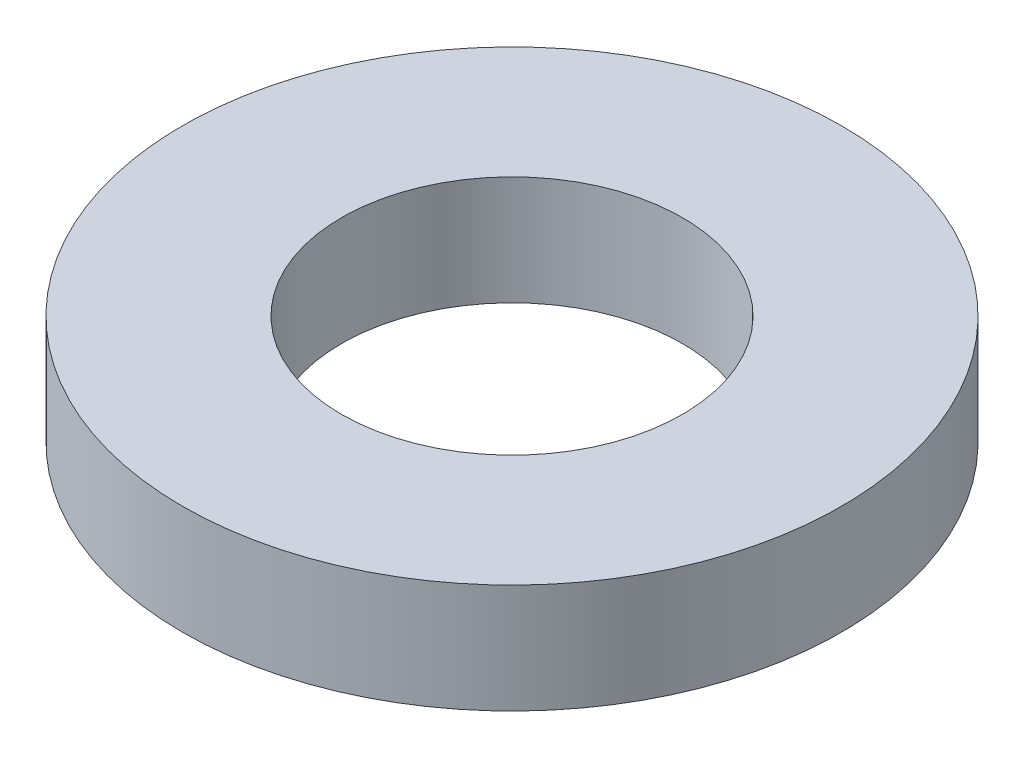
ISO-10303-21;
HEADER;
FILE_DESCRIPTION(('STEP AP214'),'2;1');
FILE_NAME('part.step','',(''),(''),'','','');
FILE_SCHEMA(('AUTOMOTIVE_DESIGN { 1 0 10303 214 1 1 1 1 }'));
ENDSEC;
DATA;
#1=APPLICATION_CONTEXT('core data for automotive mechanical design processes');
#2=APPLICATION_PROTOCOL_DEFINITION('international standard','automotive_design',2000,#1);
#3=PRODUCT_CONTEXT('',#1,'mechanical');
#4=PRODUCT('Part','Part','',(#3));
#5=PRODUCT_RELATED_PRODUCT_CATEGORY('part','',(#4));
#6=PRODUCT_DEFINITION_FORMATION('','',#4);
#7=PRODUCT_DEFINITION_CONTEXT('part definition',#1,'design');
#8=PRODUCT_DEFINITION('design','',#6,#7);
#9=PRODUCT_DEFINITION_SHAPE('','',#8);
#10=(LENGTH_UNIT() NAMED_UNIT(*) SI_UNIT(.MILLI.,.METRE.));
#11=(NAMED_UNIT(*) PLANE_ANGLE_UNIT() SI_UNIT($,.RADIAN.));
#12=(NAMED_UNIT(*) SI_UNIT($,.STERADIAN.) SOLID_ANGLE_UNIT());
#13=UNCERTAINTY_MEASURE_WITH_UNIT(LENGTH_MEASURE(1.E-05),#10,'distance_accuracy_value','');
#14=(GEOMETRIC_REPRESENTATION_CONTEXT(3) GLOBAL_UNCERTAINTY_ASSIGNED_CONTEXT((#13)) GLOBAL_UNIT_ASSIGNED_CONTEXT((#10,
#11,#12)) REPRESENTATION_CONTEXT('',''));
#15=CARTESIAN_POINT('',(0.,0.,0.));
#16=DIRECTION('',(0.,0.,1.));
#17=DIRECTION('',(1.,0.,0.));
#18=AXIS2_PLACEMENT_3D('',#15,#16,#17);
#19=CARTESIAN_POINT('',(0.,24.,0.));
#20=DIRECTION('',(0.,-1.,0.));
#21=DIRECTION('',(0.,0.,-1.));
#22=AXIS2_PLACEMENT_3D('',#19,#20,#21);
#23=CYLINDRICAL_SURFACE('',#22,72.5);
#24=CARTESIAN_POINT('',(0.,24.,0.));
#25=DIRECTION('',(0.,1.,0.));
#26=DIRECTION('',(0.,0.,1.));
#27=AXIS2_PLACEMENT_3D('',#24,#25,#26);
#28=CIRCLE('',#27,72.5);
#29=CARTESIAN_POINT('',(0.,24.,72.5));
#30=VERTEX_POINT('',#29);
#31=EDGE_CURVE('E10',#30,#30,#28,.T.);
#32=ORIENTED_EDGE('',*,*,#31,.F.);
#33=EDGE_LOOP('',(#32));
#34=FACE_BOUND('',#33,.T.);
#35=CARTESIAN_POINT('',(0.,0.,0.));
#36=DIRECTION('',(0.,1.,0.));
#37=DIRECTION('',(0.,0.,1.));
#38=AXIS2_PLACEMENT_3D('',#35,#36,#37);
#39=CIRCLE('',#38,72.5);
#40=CARTESIAN_POINT('',(0.,0.,72.5));
#41=VERTEX_POINT('',#40);
#42=EDGE_CURVE('E37',#41,#41,#39,.T.);
#43=ORIENTED_EDGE('',*,*,#42,.T.);
#44=EDGE_LOOP('',(#43));
#45=FACE_BOUND('',#44,.T.);
#46=ADVANCED_FACE('F40',(#34,#45),#23,.T.);
#47=CARTESIAN_POINT('',(0.,24.,0.));
#48=DIRECTION('',(0.,1.,0.));
#49=DIRECTION('',(0.,0.,1.));
#50=AXIS2_PLACEMENT_3D('',#47,#48,#49);
#51=PLANE('',#50);
#52=CARTESIAN_POINT('',(0.,24.,0.));
#53=DIRECTION('',(0.,1.,0.));
#54=DIRECTION('',(0.,0.,1.));
#55=AXIS2_PLACEMENT_3D('',#52,#53,#54);
#56=CIRCLE('',#55,37.5);
#57=CARTESIAN_POINT('',(0.,24.,37.5));
#58=VERTEX_POINT('',#57);
#59=EDGE_CURVE('E50',#58,#58,#56,.T.);
#60=ORIENTED_EDGE('',*,*,#59,.F.);
#61=EDGE_LOOP('',(#60));
#62=FACE_BOUND('',#61,.T.);
#63=ORIENTED_EDGE('',*,*,#31,.T.);
#64=EDGE_LOOP('',(#63));
#65=FACE_BOUND('',#64,.T.);
#66=ADVANCED_FACE('F59',(#62,#65),#51,.T.);
#67=CARTESIAN_POINT('',(0.,0.,0.));
#68=DIRECTION('',(0.,1.,0.));
#69=DIRECTION('',(0.,0.,1.));
#70=AXIS2_PLACEMENT_3D('',#67,#68,#69);
#71=PLANE('',#70);
#72=CARTESIAN_POINT('',(0.,0.,0.));
#73=DIRECTION('',(0.,1.,0.));
#74=DIRECTION('',(0.,0.,1.));
#75=AXIS2_PLACEMENT_3D('',#72,#73,#74);
#76=CIRCLE('',#75,37.5);
#77=CARTESIAN_POINT('',(0.,0.,37.5));
#78=VERTEX_POINT('',#77);
#79=EDGE_CURVE('E47',#78,#78,#76,.T.);
#80=ORIENTED_EDGE('',*,*,#79,.T.);
#81=EDGE_LOOP('',(#80));
#82=FACE_BOUND('',#81,.T.);
#83=ORIENTED_EDGE('',*,*,#42,.F.);
#84=EDGE_LOOP('',(#83));
#85=FACE_BOUND('',#84,.T.);
#86=ADVANCED_FACE('F58',(#82,#85),#71,.F.);
#87=CARTESIAN_POINT('',(0.,24.,0.));
#88=DIRECTION('',(0.,-1.,0.));
#89=DIRECTION('',(0.,0.,-1.));
#90=AXIS2_PLACEMENT_3D('',#87,#88,#89);
#91=CYLINDRICAL_SURFACE('',#90,37.5);
#92=ORIENTED_EDGE('',*,*,#59,.T.);
#93=EDGE_LOOP('',(#92));
#94=FACE_BOUND('',#93,.T.);
#95=ORIENTED_EDGE('',*,*,#79,.F.);
#96=EDGE_LOOP('',(#95));
#97=FACE_BOUND('',#96,.T.);
#98=ADVANCED_FACE('F54',(#94,#97),#91,.F.);
#99=CLOSED_SHELL('',(#46,#66,#86,#98));
#100=MANIFOLD_SOLID_BREP('B2',#99);
#101=ADVANCED_BREP_SHAPE_REPRESENTATION('',(#18,#100),#14);
#102=SHAPE_DEFINITION_REPRESENTATION(#9,#101);
ENDSEC;
END-ISO-10303-21;
